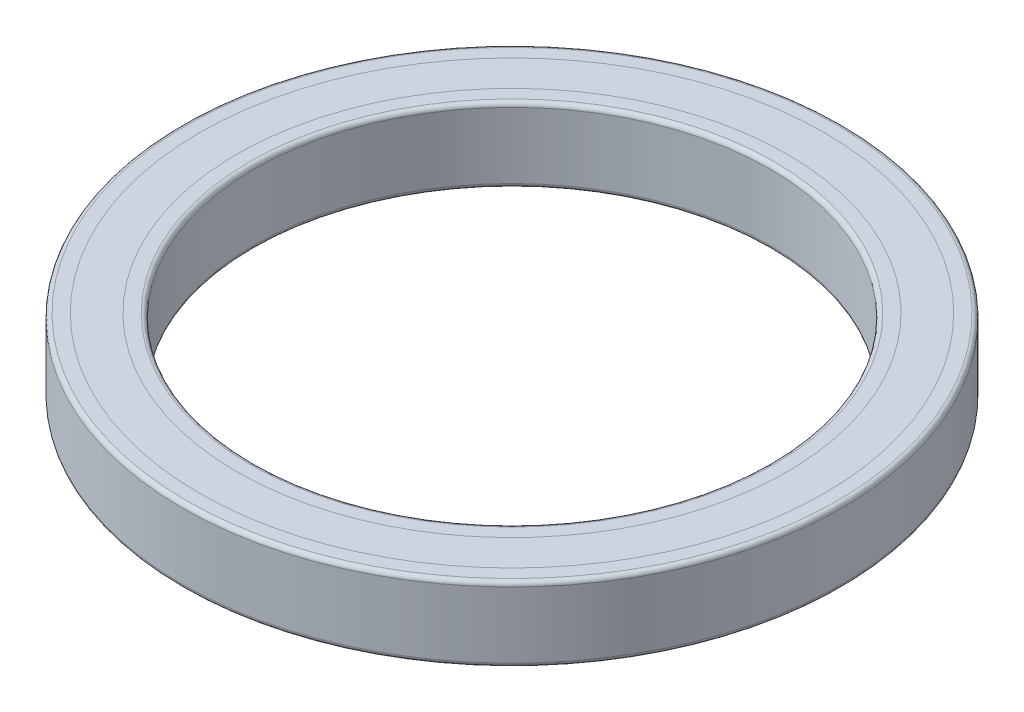
ISO-10303-21;
HEADER;
FILE_DESCRIPTION(('STEP AP214'),'2;1');
FILE_NAME('part.step','',(''),(''),'','','');
FILE_SCHEMA(('AUTOMOTIVE_DESIGN { 1 0 10303 214 1 1 1 1 }'));
ENDSEC;
DATA;
#1=APPLICATION_CONTEXT('core data for automotive mechanical design processes');
#2=APPLICATION_PROTOCOL_DEFINITION('international standard','automotive_design',2000,#1);
#3=PRODUCT_CONTEXT('',#1,'mechanical');
#4=PRODUCT('Part','Part','',(#3));
#5=PRODUCT_RELATED_PRODUCT_CATEGORY('part','',(#4));
#6=PRODUCT_DEFINITION_FORMATION('','',#4);
#7=PRODUCT_DEFINITION_CONTEXT('part definition',#1,'design');
#8=PRODUCT_DEFINITION('design','',#6,#7);
#9=PRODUCT_DEFINITION_SHAPE('','',#8);
#10=(LENGTH_UNIT() NAMED_UNIT(*) SI_UNIT(.MILLI.,.METRE.));
#11=(NAMED_UNIT(*) PLANE_ANGLE_UNIT() SI_UNIT($,.RADIAN.));
#12=(NAMED_UNIT(*) SI_UNIT($,.STERADIAN.) SOLID_ANGLE_UNIT());
#13=UNCERTAINTY_MEASURE_WITH_UNIT(LENGTH_MEASURE(1.E-05),#10,'distance_accuracy_value','');
#14=(GEOMETRIC_REPRESENTATION_CONTEXT(3) GLOBAL_UNCERTAINTY_ASSIGNED_CONTEXT((#13)) GLOBAL_UNIT_ASSIGNED_CONTEXT((#10,
#11,#12)) REPRESENTATION_CONTEXT('',''));
#15=CARTESIAN_POINT('',(0.,0.,0.));
#16=DIRECTION('',(0.,0.,1.));
#17=DIRECTION('',(1.,0.,0.));
#18=AXIS2_PLACEMENT_3D('',#15,#16,#17);
#19=CARTESIAN_POINT('',(0.,0.,0.));
#20=DIRECTION('',(0.,-1.,0.));
#21=DIRECTION('',(0.,0.,-1.));
#22=AXIS2_PLACEMENT_3D('',#19,#20,#21);
#23=CYLINDRICAL_SURFACE('',#22,54.5);
#24=CARTESIAN_POINT('',(0.,-6.5,0.));
#25=DIRECTION('',(0.,-1.,0.));
#26=DIRECTION('',(0.,0.,-1.));
#27=AXIS2_PLACEMENT_3D('',#24,#25,#26);
#28=CIRCLE('',#27,54.5);
#29=CARTESIAN_POINT('',(0.,-6.5,-54.5));
#30=VERTEX_POINT('',#29);
#31=EDGE_CURVE('E60',#30,#30,#28,.T.);
#32=ORIENTED_EDGE('',*,*,#31,.F.);
#33=EDGE_LOOP('',(#32));
#34=FACE_BOUND('',#33,.T.);
#35=CARTESIAN_POINT('',(0.,-6.,0.));
#36=DIRECTION('',(0.,-1.,0.));
#37=DIRECTION('',(0.,0.,-1.));
#38=AXIS2_PLACEMENT_3D('',#35,#36,#37);
#39=CIRCLE('',#38,54.5);
#40=CARTESIAN_POINT('',(0.,-6.,-54.5));
#41=VERTEX_POINT('',#40);
#42=EDGE_CURVE('E11',#41,#41,#39,.T.);
#43=ORIENTED_EDGE('',*,*,#42,.T.);
#44=EDGE_LOOP('',(#43));
#45=FACE_BOUND('',#44,.T.);
#46=ADVANCED_FACE('F46',(#34,#45),#23,.T.);
#47=CARTESIAN_POINT('',(0.,-6.,0.));
#48=DIRECTION('',(0.,-1.,0.));
#49=DIRECTION('',(0.,0.,-1.));
#50=AXIS2_PLACEMENT_3D('',#47,#48,#49);
#51=PLANE('',#50);
#52=ORIENTED_EDGE('',*,*,#42,.F.);
#53=EDGE_LOOP('',(#52));
#54=FACE_BOUND('',#53,.T.);
#55=CARTESIAN_POINT('',(0.,-6.,0.));
#56=DIRECTION('',(0.,-1.,0.));
#57=DIRECTION('',(0.,0.,-1.));
#58=AXIS2_PLACEMENT_3D('',#55,#56,#57);
#59=CIRCLE('',#58,48.);
#60=CARTESIAN_POINT('',(0.,-6.,-48.));
#61=VERTEX_POINT('',#60);
#62=EDGE_CURVE('E52',#61,#61,#59,.T.);
#63=ORIENTED_EDGE('',*,*,#62,.T.);
#64=EDGE_LOOP('',(#63));
#65=FACE_BOUND('',#64,.T.);
#66=ADVANCED_FACE('F70',(#54,#65),#51,.F.);
#67=CARTESIAN_POINT('',(0.,0.,0.));
#68=DIRECTION('',(0.,-1.,0.));
#69=DIRECTION('',(0.,0.,-1.));
#70=AXIS2_PLACEMENT_3D('',#67,#68,#69);
#71=CYLINDRICAL_SURFACE('',#70,48.);
#72=ORIENTED_EDGE('',*,*,#62,.F.);
#73=EDGE_LOOP('',(#72));
#74=FACE_BOUND('',#73,.T.);
#75=CARTESIAN_POINT('',(0.,-6.5,0.));
#76=DIRECTION('',(0.,-1.,0.));
#77=DIRECTION('',(0.,0.,-1.));
#78=AXIS2_PLACEMENT_3D('',#75,#76,#77);
#79=CIRCLE('',#78,48.);
#80=CARTESIAN_POINT('',(0.,-6.5,-48.));
#81=VERTEX_POINT('',#80);
#82=EDGE_CURVE('E56',#81,#81,#79,.T.);
#83=ORIENTED_EDGE('',*,*,#82,.T.);
#84=EDGE_LOOP('',(#83));
#85=FACE_BOUND('',#84,.T.);
#86=ADVANCED_FACE('F74',(#74,#85),#71,.F.);
#87=CARTESIAN_POINT('',(0.,-6.5,0.));
#88=DIRECTION('',(0.,-1.,0.));
#89=DIRECTION('',(0.,0.,-1.));
#90=AXIS2_PLACEMENT_3D('',#87,#88,#89);
#91=PLANE('',#90);
#92=ORIENTED_EDGE('',*,*,#31,.T.);
#93=EDGE_LOOP('',(#92));
#94=FACE_BOUND('',#93,.T.);
#95=ORIENTED_EDGE('',*,*,#82,.F.);
#96=EDGE_LOOP('',(#95));
#97=FACE_BOUND('',#96,.T.);
#98=ADVANCED_FACE('F66',(#94,#97),#91,.T.);
#99=CLOSED_SHELL('',(#46,#66,#86,#98));
#100=MANIFOLD_SOLID_BREP('B2',#99);
#101=CARTESIAN_POINT('',(0.,6.,0.));
#102=DIRECTION('',(0.,-1.,0.));
#103=DIRECTION('',(0.,0.,-1.));
#104=AXIS2_PLACEMENT_3D('',#101,#102,#103);
#105=PLANE('',#104);
#106=CARTESIAN_POINT('',(0.,6.,0.));
#107=DIRECTION('',(0.,-1.,0.));
#108=DIRECTION('',(0.,0.,-1.));
#109=AXIS2_PLACEMENT_3D('',#106,#107,#108);
#110=CIRCLE('',#109,54.5);
#111=CARTESIAN_POINT('',(0.,6.,-54.5));
#112=VERTEX_POINT('',#111);
#113=EDGE_CURVE('E45',#112,#112,#110,.T.);
#114=ORIENTED_EDGE('',*,*,#113,.T.);
#115=EDGE_LOOP('',(#114));
#116=FACE_BOUND('',#115,.T.);
#117=CARTESIAN_POINT('',(0.,6.,0.));
#118=DIRECTION('',(0.,-1.,0.));
#119=DIRECTION('',(0.,0.,-1.));
#120=AXIS2_PLACEMENT_3D('',#117,#118,#119);
#121=CIRCLE('',#120,48.);
#122=CARTESIAN_POINT('',(0.,6.,-48.));
#123=VERTEX_POINT('',#122);
#124=EDGE_CURVE('E130',#123,#123,#121,.T.);
#125=ORIENTED_EDGE('',*,*,#124,.F.);
#126=EDGE_LOOP('',(#125));
#127=FACE_BOUND('',#126,.T.);
#128=ADVANCED_FACE('F116',(#116,#127),#105,.T.);
#129=CARTESIAN_POINT('',(0.,0.,0.));
#130=DIRECTION('',(0.,-1.,0.));
#131=DIRECTION('',(0.,0.,-1.));
#132=AXIS2_PLACEMENT_3D('',#129,#130,#131);
#133=CYLINDRICAL_SURFACE('',#132,54.5);
#134=CARTESIAN_POINT('',(0.,6.5,0.));
#135=DIRECTION('',(0.,-1.,0.));
#136=DIRECTION('',(0.,0.,-1.));
#137=AXIS2_PLACEMENT_3D('',#134,#135,#136);
#138=CIRCLE('',#137,54.5);
#139=CARTESIAN_POINT('',(0.,6.5,-54.5));
#140=VERTEX_POINT('',#139);
#141=EDGE_CURVE('E122',#140,#140,#138,.T.);
#142=ORIENTED_EDGE('',*,*,#141,.T.);
#143=EDGE_LOOP('',(#142));
#144=FACE_BOUND('',#143,.T.);
#145=ORIENTED_EDGE('',*,*,#113,.F.);
#146=EDGE_LOOP('',(#145));
#147=FACE_BOUND('',#146,.T.);
#148=ADVANCED_FACE('F140',(#144,#147),#133,.T.);
#149=CARTESIAN_POINT('',(0.,6.5,0.));
#150=DIRECTION('',(0.,-1.,0.));
#151=DIRECTION('',(0.,0.,-1.));
#152=AXIS2_PLACEMENT_3D('',#149,#150,#151);
#153=PLANE('',#152);
#154=ORIENTED_EDGE('',*,*,#141,.F.);
#155=EDGE_LOOP('',(#154));
#156=FACE_BOUND('',#155,.T.);
#157=CARTESIAN_POINT('',(0.,6.5,0.));
#158=DIRECTION('',(0.,-1.,0.));
#159=DIRECTION('',(0.,0.,-1.));
#160=AXIS2_PLACEMENT_3D('',#157,#158,#159);
#161=CIRCLE('',#160,48.);
#162=CARTESIAN_POINT('',(0.,6.5,-48.));
#163=VERTEX_POINT('',#162);
#164=EDGE_CURVE('E126',#163,#163,#161,.T.);
#165=ORIENTED_EDGE('',*,*,#164,.T.);
#166=EDGE_LOOP('',(#165));
#167=FACE_BOUND('',#166,.T.);
#168=ADVANCED_FACE('F144',(#156,#167),#153,.F.);
#169=CARTESIAN_POINT('',(0.,0.,0.));
#170=DIRECTION('',(0.,-1.,0.));
#171=DIRECTION('',(0.,0.,-1.));
#172=AXIS2_PLACEMENT_3D('',#169,#170,#171);
#173=CYLINDRICAL_SURFACE('',#172,48.);
#174=ORIENTED_EDGE('',*,*,#124,.T.);
#175=EDGE_LOOP('',(#174));
#176=FACE_BOUND('',#175,.T.);
#177=ORIENTED_EDGE('',*,*,#164,.F.);
#178=EDGE_LOOP('',(#177));
#179=FACE_BOUND('',#178,.T.);
#180=ADVANCED_FACE('F136',(#176,#179),#173,.F.);
#181=CLOSED_SHELL('',(#128,#148,#168,#180));
#182=MANIFOLD_SOLID_BREP('B6',#181);
#183=CARTESIAN_POINT('',(0.,0.,0.));
#184=DIRECTION('',(0.,-1.,0.));
#185=DIRECTION('',(0.,0.,-1.));
#186=AXIS2_PLACEMENT_3D('',#183,#184,#185);
#187=TOROIDAL_SURFACE('',#186,51.25,3.5);
#188=CARTESIAN_POINT('',(0.,2.87228132326902,0.));
#189=DIRECTION('',(0.,-1.,0.));
#190=DIRECTION('',(0.,0.,-1.));
#191=AXIS2_PLACEMENT_3D('',#188,#189,#190);
#192=CIRCLE('',#191,53.25);
#193=CARTESIAN_POINT('',(0.,2.87228132326902,-53.25));
#194=VERTEX_POINT('',#193);
#195=EDGE_CURVE('E226',#194,#194,#192,.T.);
#196=ORIENTED_EDGE('',*,*,#195,.F.);
#197=EDGE_LOOP('',(#196));
#198=FACE_BOUND('',#197,.T.);
#199=CARTESIAN_POINT('',(0.,-2.87228132326901,0.));
#200=DIRECTION('',(0.,-1.,0.));
#201=DIRECTION('',(0.,0.,-1.));
#202=AXIS2_PLACEMENT_3D('',#199,#200,#201);
#203=CIRCLE('',#202,53.25);
#204=CARTESIAN_POINT('',(0.,-2.87228132326901,-53.25));
#205=VERTEX_POINT('',#204);
#206=EDGE_CURVE('E205',#205,#205,#203,.T.);
#207=ORIENTED_EDGE('',*,*,#206,.T.);
#208=EDGE_LOOP('',(#207));
#209=FACE_BOUND('',#208,.T.);
#210=ADVANCED_FACE('F185',(#198,#209),#187,.F.);
#211=CARTESIAN_POINT('',(0.,0.,0.));
#212=DIRECTION('',(0.,-1.,0.));
#213=DIRECTION('',(0.,0.,-1.));
#214=AXIS2_PLACEMENT_3D('',#211,#212,#213);
#215=CYLINDRICAL_SURFACE('',#214,53.25);
#216=CARTESIAN_POINT('',(0.,-6.,0.));
#217=DIRECTION('',(0.,-1.,0.));
#218=DIRECTION('',(0.,0.,-1.));
#219=AXIS2_PLACEMENT_3D('',#216,#217,#218);
#220=CIRCLE('',#219,53.25);
#221=CARTESIAN_POINT('',(0.,-6.,-53.25));
#222=VERTEX_POINT('',#221);
#223=EDGE_CURVE('E208',#222,#222,#220,.T.);
#224=ORIENTED_EDGE('',*,*,#223,.T.);
#225=EDGE_LOOP('',(#224));
#226=FACE_BOUND('',#225,.T.);
#227=ORIENTED_EDGE('',*,*,#206,.F.);
#228=EDGE_LOOP('',(#227));
#229=FACE_BOUND('',#228,.T.);
#230=ADVANCED_FACE('F234',(#226,#229),#215,.F.);
#231=CARTESIAN_POINT('',(0.,-6.,0.));
#232=DIRECTION('',(0.,-1.,0.));
#233=DIRECTION('',(0.,0.,-1.));
#234=AXIS2_PLACEMENT_3D('',#231,#232,#233);
#235=PLANE('',#234);
#236=CARTESIAN_POINT('',(0.,-6.,0.));
#237=DIRECTION('',(0.,-1.,0.));
#238=DIRECTION('',(0.,0.,-1.));
#239=AXIS2_PLACEMENT_3D('',#236,#237,#238);
#240=CIRCLE('',#239,54.5);
#241=CARTESIAN_POINT('',(0.,-6.,-54.5));
#242=VERTEX_POINT('',#241);
#243=EDGE_CURVE('E211',#242,#242,#240,.T.);
#244=ORIENTED_EDGE('',*,*,#243,.T.);
#245=EDGE_LOOP('',(#244));
#246=FACE_BOUND('',#245,.T.);
#247=ORIENTED_EDGE('',*,*,#223,.F.);
#248=EDGE_LOOP('',(#247));
#249=FACE_BOUND('',#248,.T.);
#250=ADVANCED_FACE('F239',(#246,#249),#235,.T.);
#251=CARTESIAN_POINT('',(0.,0.,0.));
#252=DIRECTION('',(0.,-1.,0.));
#253=DIRECTION('',(0.,0.,-1.));
#254=AXIS2_PLACEMENT_3D('',#251,#252,#253);
#255=CYLINDRICAL_SURFACE('',#254,54.5);
#256=CARTESIAN_POINT('',(0.,-6.5,0.));
#257=DIRECTION('',(0.,-1.,0.));
#258=DIRECTION('',(0.,0.,-1.));
#259=AXIS2_PLACEMENT_3D('',#256,#257,#258);
#260=CIRCLE('',#259,54.5);
#261=CARTESIAN_POINT('',(0.,-6.5,-54.5));
#262=VERTEX_POINT('',#261);
#263=EDGE_CURVE('E214',#262,#262,#260,.T.);
#264=ORIENTED_EDGE('',*,*,#263,.T.);
#265=EDGE_LOOP('',(#264));
#266=FACE_BOUND('',#265,.T.);
#267=ORIENTED_EDGE('',*,*,#243,.F.);
#268=EDGE_LOOP('',(#267));
#269=FACE_BOUND('',#268,.T.);
#270=ADVANCED_FACE('F245',(#266,#269),#255,.F.);
#271=CARTESIAN_POINT('',(0.,-6.5,0.));
#272=DIRECTION('',(0.,-1.,0.));
#273=DIRECTION('',(0.,0.,-1.));
#274=AXIS2_PLACEMENT_3D('',#271,#272,#273);
#275=PLANE('',#274);
#276=CARTESIAN_POINT('',(0.,-6.5,0.));
#277=DIRECTION('',(0.,-1.,0.));
#278=DIRECTION('',(0.,0.,-1.));
#279=AXIS2_PLACEMENT_3D('',#276,#277,#278);
#280=CIRCLE('',#279,56.75);
#281=CARTESIAN_POINT('',(0.,-6.5,-56.75));
#282=VERTEX_POINT('',#281);
#283=EDGE_CURVE('E200',#282,#282,#280,.T.);
#284=ORIENTED_EDGE('',*,*,#283,.T.);
#285=EDGE_LOOP('',(#284));
#286=FACE_BOUND('',#285,.T.);
#287=ORIENTED_EDGE('',*,*,#263,.F.);
#288=EDGE_LOOP('',(#287));
#289=FACE_BOUND('',#288,.T.);
#290=ADVANCED_FACE('F263',(#286,#289),#275,.T.);
#291=CARTESIAN_POINT('',(0.,0.,0.));
#292=DIRECTION('',(0.,-1.,0.));
#293=DIRECTION('',(0.,0.,-1.));
#294=AXIS2_PLACEMENT_3D('',#291,#292,#293);
#295=CYLINDRICAL_SURFACE('',#294,57.5);
#296=CARTESIAN_POINT('',(0.,-5.75,0.));
#297=DIRECTION('',(0.,-1.,0.));
#298=DIRECTION('',(0.,0.,-1.));
#299=AXIS2_PLACEMENT_3D('',#296,#297,#298);
#300=CIRCLE('',#299,57.5);
#301=CARTESIAN_POINT('',(0.,-5.75,-57.5));
#302=VERTEX_POINT('',#301);
#303=EDGE_CURVE('E192',#302,#302,#300,.F.);
#304=ORIENTED_EDGE('',*,*,#303,.T.);
#305=EDGE_LOOP('',(#304));
#306=FACE_BOUND('',#305,.T.);
#307=CARTESIAN_POINT('',(0.,5.75,0.));
#308=DIRECTION('',(0.,-1.,0.));
#309=DIRECTION('',(0.,0.,-1.));
#310=AXIS2_PLACEMENT_3D('',#307,#308,#309);
#311=CIRCLE('',#310,57.5);
#312=CARTESIAN_POINT('',(0.,5.75,-57.5));
#313=VERTEX_POINT('',#312);
#314=EDGE_CURVE('E196',#313,#313,#311,.T.);
#315=ORIENTED_EDGE('',*,*,#314,.T.);
#316=EDGE_LOOP('',(#315));
#317=FACE_BOUND('',#316,.T.);
#318=ADVANCED_FACE('F266',(#306,#317),#295,.T.);
#319=CARTESIAN_POINT('',(0.,6.5,0.));
#320=DIRECTION('',(0.,-1.,0.));
#321=DIRECTION('',(0.,0.,-1.));
#322=AXIS2_PLACEMENT_3D('',#319,#320,#321);
#323=PLANE('',#322);
#324=CARTESIAN_POINT('',(0.,6.5,0.));
#325=DIRECTION('',(0.,-1.,0.));
#326=DIRECTION('',(0.,0.,-1.));
#327=AXIS2_PLACEMENT_3D('',#324,#325,#326);
#328=CIRCLE('',#327,56.75);
#329=CARTESIAN_POINT('',(0.,6.5,-56.75));
#330=VERTEX_POINT('',#329);
#331=EDGE_CURVE('E115',#330,#330,#328,.F.);
#332=ORIENTED_EDGE('',*,*,#331,.T.);
#333=EDGE_LOOP('',(#332));
#334=FACE_BOUND('',#333,.T.);
#335=CARTESIAN_POINT('',(0.,6.5,0.));
#336=DIRECTION('',(0.,-1.,0.));
#337=DIRECTION('',(0.,0.,-1.));
#338=AXIS2_PLACEMENT_3D('',#335,#336,#337);
#339=CIRCLE('',#338,54.5);
#340=CARTESIAN_POINT('',(0.,6.5,-54.5));
#341=VERTEX_POINT('',#340);
#342=EDGE_CURVE('E217',#341,#341,#339,.T.);
#343=ORIENTED_EDGE('',*,*,#342,.T.);
#344=EDGE_LOOP('',(#343));
#345=FACE_BOUND('',#344,.T.);
#346=ADVANCED_FACE('F280',(#334,#345),#323,.F.);
#347=CARTESIAN_POINT('',(0.,0.,0.));
#348=DIRECTION('',(0.,-1.,0.));
#349=DIRECTION('',(0.,0.,-1.));
#350=AXIS2_PLACEMENT_3D('',#347,#348,#349);
#351=CYLINDRICAL_SURFACE('',#350,54.5);
#352=ORIENTED_EDGE('',*,*,#342,.F.);
#353=EDGE_LOOP('',(#352));
#354=FACE_BOUND('',#353,.T.);
#355=CARTESIAN_POINT('',(0.,6.,0.));
#356=DIRECTION('',(0.,-1.,0.));
#357=DIRECTION('',(0.,0.,-1.));
#358=AXIS2_PLACEMENT_3D('',#355,#356,#357);
#359=CIRCLE('',#358,54.5);
#360=CARTESIAN_POINT('',(0.,6.,-54.5));
#361=VERTEX_POINT('',#360);
#362=EDGE_CURVE('E220',#361,#361,#359,.T.);
#363=ORIENTED_EDGE('',*,*,#362,.T.);
#364=EDGE_LOOP('',(#363));
#365=FACE_BOUND('',#364,.T.);
#366=ADVANCED_FACE('F283',(#354,#365),#351,.F.);
#367=CARTESIAN_POINT('',(0.,6.,0.));
#368=DIRECTION('',(0.,-1.,0.));
#369=DIRECTION('',(0.,0.,-1.));
#370=AXIS2_PLACEMENT_3D('',#367,#368,#369);
#371=PLANE('',#370);
#372=ORIENTED_EDGE('',*,*,#362,.F.);
#373=EDGE_LOOP('',(#372));
#374=FACE_BOUND('',#373,.T.);
#375=CARTESIAN_POINT('',(0.,6.,0.));
#376=DIRECTION('',(0.,-1.,0.));
#377=DIRECTION('',(0.,0.,-1.));
#378=AXIS2_PLACEMENT_3D('',#375,#376,#377);
#379=CIRCLE('',#378,53.25);
#380=CARTESIAN_POINT('',(0.,6.,-53.25));
#381=VERTEX_POINT('',#380);
#382=EDGE_CURVE('E223',#381,#381,#379,.T.);
#383=ORIENTED_EDGE('',*,*,#382,.T.);
#384=EDGE_LOOP('',(#383));
#385=FACE_BOUND('',#384,.T.);
#386=ADVANCED_FACE('F257',(#374,#385),#371,.F.);
#387=CARTESIAN_POINT('',(0.,0.,0.));
#388=DIRECTION('',(0.,-1.,0.));
#389=DIRECTION('',(0.,0.,-1.));
#390=AXIS2_PLACEMENT_3D('',#387,#388,#389);
#391=CYLINDRICAL_SURFACE('',#390,53.25);
#392=ORIENTED_EDGE('',*,*,#382,.F.);
#393=EDGE_LOOP('',(#392));
#394=FACE_BOUND('',#393,.T.);
#395=ORIENTED_EDGE('',*,*,#195,.T.);
#396=EDGE_LOOP('',(#395));
#397=FACE_BOUND('',#396,.T.);
#398=ADVANCED_FACE('F230',(#394,#397),#391,.F.);
#399=CARTESIAN_POINT('',(0.,-5.75,0.));
#400=DIRECTION('',(0.,-1.,0.));
#401=DIRECTION('',(0.,0.,-1.));
#402=AXIS2_PLACEMENT_3D('',#399,#400,#401);
#403=TOROIDAL_SURFACE('',#402,56.75,0.75);
#404=ORIENTED_EDGE('',*,*,#303,.F.);
#405=EDGE_LOOP('',(#404));
#406=FACE_BOUND('',#405,.T.);
#407=ORIENTED_EDGE('',*,*,#283,.F.);
#408=EDGE_LOOP('',(#407));
#409=FACE_BOUND('',#408,.T.);
#410=ADVANCED_FACE('F249',(#406,#409),#403,.T.);
#411=CARTESIAN_POINT('',(0.,5.75,0.));
#412=DIRECTION('',(0.,-1.,0.));
#413=DIRECTION('',(0.,0.,-1.));
#414=AXIS2_PLACEMENT_3D('',#411,#412,#413);
#415=TOROIDAL_SURFACE('',#414,56.75,0.75);
#416=ORIENTED_EDGE('',*,*,#331,.F.);
#417=EDGE_LOOP('',(#416));
#418=FACE_BOUND('',#417,.T.);
#419=ORIENTED_EDGE('',*,*,#314,.F.);
#420=EDGE_LOOP('',(#419));
#421=FACE_BOUND('',#420,.T.);
#422=ADVANCED_FACE('F187',(#418,#421),#415,.T.);
#423=CLOSED_SHELL('',(#210,#230,#250,#270,#290,#318,#346,#366,#386,#398,#410,#422));
#424=MANIFOLD_SOLID_BREP('B40',#423);
#425=CARTESIAN_POINT('',(0.,0.,0.));
#426=DIRECTION('',(0.,-1.,0.));
#427=DIRECTION('',(0.,0.,-1.));
#428=AXIS2_PLACEMENT_3D('',#425,#426,#427);
#429=TOROIDAL_SURFACE('',#428,51.25,3.5);
#430=CARTESIAN_POINT('',(0.,-2.87228132326901,0.));
#431=DIRECTION('',(0.,-1.,0.));
#432=DIRECTION('',(0.,0.,-1.));
#433=AXIS2_PLACEMENT_3D('',#430,#431,#432);
#434=CIRCLE('',#433,49.25);
#435=CARTESIAN_POINT('',(0.,-2.87228132326901,-49.25));
#436=VERTEX_POINT('',#435);
#437=EDGE_CURVE('E408',#436,#436,#434,.T.);
#438=ORIENTED_EDGE('',*,*,#437,.F.);
#439=EDGE_LOOP('',(#438));
#440=FACE_BOUND('',#439,.T.);
#441=CARTESIAN_POINT('',(0.,2.87228132326902,0.));
#442=DIRECTION('',(0.,-1.,0.));
#443=DIRECTION('',(0.,0.,-1.));
#444=AXIS2_PLACEMENT_3D('',#441,#442,#443);
#445=CIRCLE('',#444,49.25);
#446=CARTESIAN_POINT('',(0.,2.87228132326902,-49.25));
#447=VERTEX_POINT('',#446);
#448=EDGE_CURVE('E387',#447,#447,#445,.T.);
#449=ORIENTED_EDGE('',*,*,#448,.T.);
#450=EDGE_LOOP('',(#449));
#451=FACE_BOUND('',#450,.T.);
#452=ADVANCED_FACE('F367',(#440,#451),#429,.F.);
#453=CARTESIAN_POINT('',(0.,0.,0.));
#454=DIRECTION('',(0.,-1.,0.));
#455=DIRECTION('',(0.,0.,-1.));
#456=AXIS2_PLACEMENT_3D('',#453,#454,#455);
#457=CYLINDRICAL_SURFACE('',#456,49.25);
#458=CARTESIAN_POINT('',(0.,6.,0.));
#459=DIRECTION('',(0.,-1.,0.));
#460=DIRECTION('',(0.,0.,-1.));
#461=AXIS2_PLACEMENT_3D('',#458,#459,#460);
#462=CIRCLE('',#461,49.25);
#463=CARTESIAN_POINT('',(0.,6.,-49.25));
#464=VERTEX_POINT('',#463);
#465=EDGE_CURVE('E390',#464,#464,#462,.T.);
#466=ORIENTED_EDGE('',*,*,#465,.T.);
#467=EDGE_LOOP('',(#466));
#468=FACE_BOUND('',#467,.T.);
#469=ORIENTED_EDGE('',*,*,#448,.F.);
#470=EDGE_LOOP('',(#469));
#471=FACE_BOUND('',#470,.T.);
#472=ADVANCED_FACE('F416',(#468,#471),#457,.T.);
#473=CARTESIAN_POINT('',(0.,6.,0.));
#474=DIRECTION('',(0.,-1.,0.));
#475=DIRECTION('',(0.,0.,-1.));
#476=AXIS2_PLACEMENT_3D('',#473,#474,#475);
#477=PLANE('',#476);
#478=ORIENTED_EDGE('',*,*,#465,.F.);
#479=EDGE_LOOP('',(#478));
#480=FACE_BOUND('',#479,.T.);
#481=CARTESIAN_POINT('',(0.,6.,0.));
#482=DIRECTION('',(0.,-1.,0.));
#483=DIRECTION('',(0.,0.,-1.));
#484=AXIS2_PLACEMENT_3D('',#481,#482,#483);
#485=CIRCLE('',#484,48.);
#486=CARTESIAN_POINT('',(0.,6.,-48.));
#487=VERTEX_POINT('',#486);
#488=EDGE_CURVE('E393',#487,#487,#485,.T.);
#489=ORIENTED_EDGE('',*,*,#488,.T.);
#490=EDGE_LOOP('',(#489));
#491=FACE_BOUND('',#490,.T.);
#492=ADVANCED_FACE('F421',(#480,#491),#477,.F.);
#493=CARTESIAN_POINT('',(0.,0.,0.));
#494=DIRECTION('',(0.,-1.,0.));
#495=DIRECTION('',(0.,0.,-1.));
#496=AXIS2_PLACEMENT_3D('',#493,#494,#495);
#497=CYLINDRICAL_SURFACE('',#496,48.);
#498=ORIENTED_EDGE('',*,*,#488,.F.);
#499=EDGE_LOOP('',(#498));
#500=FACE_BOUND('',#499,.T.);
#501=CARTESIAN_POINT('',(0.,6.5,0.));
#502=DIRECTION('',(0.,-1.,0.));
#503=DIRECTION('',(0.,0.,-1.));
#504=AXIS2_PLACEMENT_3D('',#501,#502,#503);
#505=CIRCLE('',#504,48.);
#506=CARTESIAN_POINT('',(0.,6.5,-48.));
#507=VERTEX_POINT('',#506);
#508=EDGE_CURVE('E396',#507,#507,#505,.T.);
#509=ORIENTED_EDGE('',*,*,#508,.T.);
#510=EDGE_LOOP('',(#509));
#511=FACE_BOUND('',#510,.T.);
#512=ADVANCED_FACE('F427',(#500,#511),#497,.T.);
#513=CARTESIAN_POINT('',(0.,6.5,0.));
#514=DIRECTION('',(0.,-1.,0.));
#515=DIRECTION('',(0.,0.,-1.));
#516=AXIS2_PLACEMENT_3D('',#513,#514,#515);
#517=PLANE('',#516);
#518=CARTESIAN_POINT('',(0.,6.5,0.));
#519=DIRECTION('',(0.,-1.,0.));
#520=DIRECTION('',(0.,0.,-1.));
#521=AXIS2_PLACEMENT_3D('',#518,#519,#520);
#522=CIRCLE('',#521,45.75);
#523=CARTESIAN_POINT('',(0.,6.5,-45.75));
#524=VERTEX_POINT('',#523);
#525=EDGE_CURVE('E184',#524,#524,#522,.T.);
#526=ORIENTED_EDGE('',*,*,#525,.T.);
#527=EDGE_LOOP('',(#526));
#528=FACE_BOUND('',#527,.T.);
#529=ORIENTED_EDGE('',*,*,#508,.F.);
#530=EDGE_LOOP('',(#529));
#531=FACE_BOUND('',#530,.T.);
#532=ADVANCED_FACE('F449',(#528,#531),#517,.F.);
#533=CARTESIAN_POINT('',(0.,0.,0.));
#534=DIRECTION('',(0.,-1.,0.));
#535=DIRECTION('',(0.,0.,-1.));
#536=AXIS2_PLACEMENT_3D('',#533,#534,#535);
#537=CYLINDRICAL_SURFACE('',#536,45.);
#538=CARTESIAN_POINT('',(0.,-5.75,0.));
#539=DIRECTION('',(0.,-1.,0.));
#540=DIRECTION('',(0.,0.,-1.));
#541=AXIS2_PLACEMENT_3D('',#538,#539,#540);
#542=CIRCLE('',#541,45.);
#543=CARTESIAN_POINT('',(0.,-5.75,-45.));
#544=VERTEX_POINT('',#543);
#545=EDGE_CURVE('E378',#544,#544,#542,.T.);
#546=ORIENTED_EDGE('',*,*,#545,.T.);
#547=EDGE_LOOP('',(#546));
#548=FACE_BOUND('',#547,.T.);
#549=CARTESIAN_POINT('',(0.,5.75,0.));
#550=DIRECTION('',(0.,-1.,0.));
#551=DIRECTION('',(0.,0.,-1.));
#552=AXIS2_PLACEMENT_3D('',#549,#550,#551);
#553=CIRCLE('',#552,45.);
#554=CARTESIAN_POINT('',(0.,5.75,-45.));
#555=VERTEX_POINT('',#554);
#556=EDGE_CURVE('E382',#555,#555,#553,.F.);
#557=ORIENTED_EDGE('',*,*,#556,.T.);
#558=EDGE_LOOP('',(#557));
#559=FACE_BOUND('',#558,.T.);
#560=ADVANCED_FACE('F445',(#548,#559),#537,.F.);
#561=CARTESIAN_POINT('',(0.,-6.5,0.));
#562=DIRECTION('',(0.,-1.,0.));
#563=DIRECTION('',(0.,0.,-1.));
#564=AXIS2_PLACEMENT_3D('',#561,#562,#563);
#565=PLANE('',#564);
#566=CARTESIAN_POINT('',(0.,-6.5,0.));
#567=DIRECTION('',(0.,-1.,0.));
#568=DIRECTION('',(0.,0.,-1.));
#569=AXIS2_PLACEMENT_3D('',#566,#567,#568);
#570=CIRCLE('',#569,45.75);
#571=CARTESIAN_POINT('',(0.,-6.5,-45.75));
#572=VERTEX_POINT('',#571);
#573=EDGE_CURVE('E374',#572,#572,#570,.F.);
#574=ORIENTED_EDGE('',*,*,#573,.T.);
#575=EDGE_LOOP('',(#574));
#576=FACE_BOUND('',#575,.T.);
#577=CARTESIAN_POINT('',(0.,-6.5,0.));
#578=DIRECTION('',(0.,-1.,0.));
#579=DIRECTION('',(0.,0.,-1.));
#580=AXIS2_PLACEMENT_3D('',#577,#578,#579);
#581=CIRCLE('',#580,48.);
#582=CARTESIAN_POINT('',(0.,-6.5,-48.));
#583=VERTEX_POINT('',#582);
#584=EDGE_CURVE('E399',#583,#583,#581,.T.);
#585=ORIENTED_EDGE('',*,*,#584,.T.);
#586=EDGE_LOOP('',(#585));
#587=FACE_BOUND('',#586,.T.);
#588=ADVANCED_FACE('F448',(#576,#587),#565,.T.);
#589=CARTESIAN_POINT('',(0.,0.,0.));
#590=DIRECTION('',(0.,-1.,0.));
#591=DIRECTION('',(0.,0.,-1.));
#592=AXIS2_PLACEMENT_3D('',#589,#590,#591);
#593=CYLINDRICAL_SURFACE('',#592,48.);
#594=CARTESIAN_POINT('',(0.,-6.,0.));
#595=DIRECTION('',(0.,-1.,0.));
#596=DIRECTION('',(0.,0.,-1.));
#597=AXIS2_PLACEMENT_3D('',#594,#595,#596);
#598=CIRCLE('',#597,48.);
#599=CARTESIAN_POINT('',(0.,-6.,-48.));
#600=VERTEX_POINT('',#599);
#601=EDGE_CURVE('E402',#600,#600,#598,.T.);
#602=ORIENTED_EDGE('',*,*,#601,.T.);
#603=EDGE_LOOP('',(#602));
#604=FACE_BOUND('',#603,.T.);
#605=ORIENTED_EDGE('',*,*,#584,.F.);
#606=EDGE_LOOP('',(#605));
#607=FACE_BOUND('',#606,.T.);
#608=ADVANCED_FACE('F457',(#604,#607),#593,.T.);
#609=CARTESIAN_POINT('',(0.,-6.,0.));
#610=DIRECTION('',(0.,-1.,0.));
#611=DIRECTION('',(0.,0.,-1.));
#612=AXIS2_PLACEMENT_3D('',#609,#610,#611);
#613=PLANE('',#612);
#614=CARTESIAN_POINT('',(0.,-6.,0.));
#615=DIRECTION('',(0.,-1.,0.));
#616=DIRECTION('',(0.,0.,-1.));
#617=AXIS2_PLACEMENT_3D('',#614,#615,#616);
#618=CIRCLE('',#617,49.25);
#619=CARTESIAN_POINT('',(0.,-6.,-49.25));
#620=VERTEX_POINT('',#619);
#621=EDGE_CURVE('E405',#620,#620,#618,.T.);
#622=ORIENTED_EDGE('',*,*,#621,.T.);
#623=EDGE_LOOP('',(#622));
#624=FACE_BOUND('',#623,.T.);
#625=ORIENTED_EDGE('',*,*,#601,.F.);
#626=EDGE_LOOP('',(#625));
#627=FACE_BOUND('',#626,.T.);
#628=ADVANCED_FACE('F439',(#624,#627),#613,.T.);
#629=CARTESIAN_POINT('',(0.,0.,0.));
#630=DIRECTION('',(0.,-1.,0.));
#631=DIRECTION('',(0.,0.,-1.));
#632=AXIS2_PLACEMENT_3D('',#629,#630,#631);
#633=CYLINDRICAL_SURFACE('',#632,49.25);
#634=ORIENTED_EDGE('',*,*,#621,.F.);
#635=EDGE_LOOP('',(#634));
#636=FACE_BOUND('',#635,.T.);
#637=ORIENTED_EDGE('',*,*,#437,.T.);
#638=EDGE_LOOP('',(#637));
#639=FACE_BOUND('',#638,.T.);
#640=ADVANCED_FACE('F412',(#636,#639),#633,.T.);
#641=CARTESIAN_POINT('',(0.,-5.75,0.));
#642=DIRECTION('',(0.,-1.,0.));
#643=DIRECTION('',(0.,0.,-1.));
#644=AXIS2_PLACEMENT_3D('',#641,#642,#643);
#645=TOROIDAL_SURFACE('',#644,45.75,0.75);
#646=ORIENTED_EDGE('',*,*,#573,.F.);
#647=EDGE_LOOP('',(#646));
#648=FACE_BOUND('',#647,.T.);
#649=ORIENTED_EDGE('',*,*,#545,.F.);
#650=EDGE_LOOP('',(#649));
#651=FACE_BOUND('',#650,.T.);
#652=ADVANCED_FACE('F431',(#648,#651),#645,.T.);
#653=CARTESIAN_POINT('',(0.,5.75,0.));
#654=DIRECTION('',(0.,-1.,0.));
#655=DIRECTION('',(0.,0.,-1.));
#656=AXIS2_PLACEMENT_3D('',#653,#654,#655);
#657=TOROIDAL_SURFACE('',#656,45.75,0.75);
#658=ORIENTED_EDGE('',*,*,#556,.F.);
#659=EDGE_LOOP('',(#658));
#660=FACE_BOUND('',#659,.T.);
#661=ORIENTED_EDGE('',*,*,#525,.F.);
#662=EDGE_LOOP('',(#661));
#663=FACE_BOUND('',#662,.T.);
#664=ADVANCED_FACE('F369',(#660,#663),#657,.T.);
#665=CLOSED_SHELL('',(#452,#472,#492,#512,#532,#560,#588,#608,#628,#640,#652,#664));
#666=MANIFOLD_SOLID_BREP('B110',#665);
#667=ADVANCED_BREP_SHAPE_REPRESENTATION('',(#18,#100,#182,#424,#666),#14);
#668=SHAPE_DEFINITION_REPRESENTATION(#9,#667);
ENDSEC;
END-ISO-10303-21;
